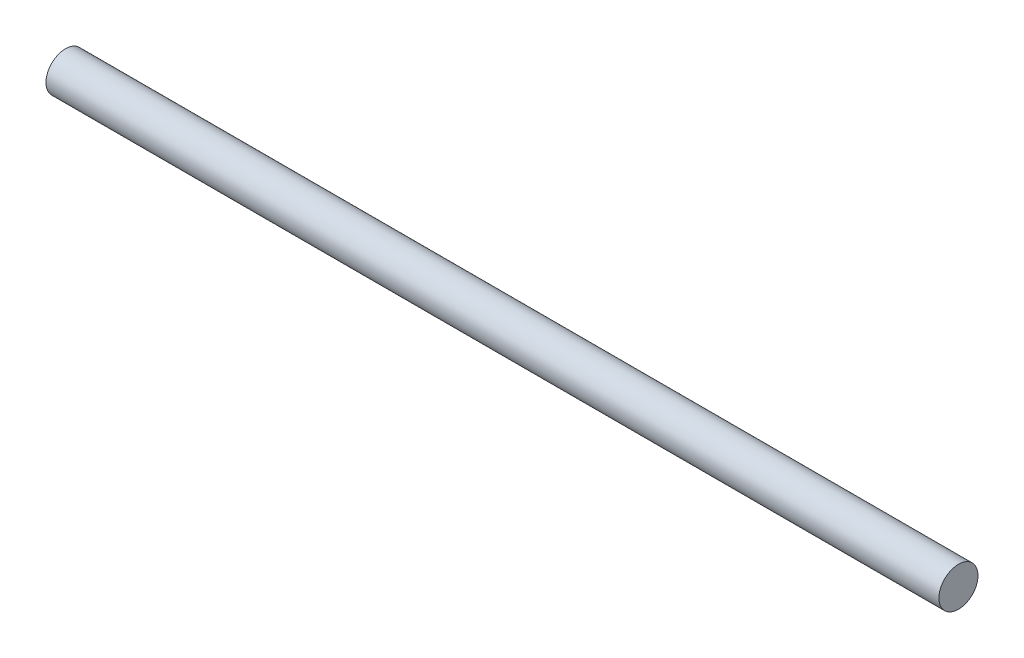
ISO-10303-21;
HEADER;
FILE_DESCRIPTION(('STEP AP214'),'2;1');
FILE_NAME('part.step','',(''),(''),'','','');
FILE_SCHEMA(('AUTOMOTIVE_DESIGN { 1 0 10303 214 1 1 1 1 }'));
ENDSEC;
DATA;
#1=APPLICATION_CONTEXT('core data for automotive mechanical design processes');
#2=APPLICATION_PROTOCOL_DEFINITION('international standard','automotive_design',2000,#1);
#3=PRODUCT_CONTEXT('',#1,'mechanical');
#4=PRODUCT('Part','Part','',(#3));
#5=PRODUCT_RELATED_PRODUCT_CATEGORY('part','',(#4));
#6=PRODUCT_DEFINITION_FORMATION('','',#4);
#7=PRODUCT_DEFINITION_CONTEXT('part definition',#1,'design');
#8=PRODUCT_DEFINITION('design','',#6,#7);
#9=PRODUCT_DEFINITION_SHAPE('','',#8);
#10=(LENGTH_UNIT() NAMED_UNIT(*) SI_UNIT(.MILLI.,.METRE.));
#11=(NAMED_UNIT(*) PLANE_ANGLE_UNIT() SI_UNIT($,.RADIAN.));
#12=(NAMED_UNIT(*) SI_UNIT($,.STERADIAN.) SOLID_ANGLE_UNIT());
#13=UNCERTAINTY_MEASURE_WITH_UNIT(LENGTH_MEASURE(1.E-05),#10,'distance_accuracy_value','');
#14=(GEOMETRIC_REPRESENTATION_CONTEXT(3) GLOBAL_UNCERTAINTY_ASSIGNED_CONTEXT((#13)) GLOBAL_UNIT_ASSIGNED_CONTEXT((#10,
#11,#12)) REPRESENTATION_CONTEXT('',''));
#15=CARTESIAN_POINT('',(0.,0.,0.));
#16=DIRECTION('',(0.,0.,1.));
#17=DIRECTION('',(1.,0.,0.));
#18=AXIS2_PLACEMENT_3D('',#15,#16,#17);
#19=CARTESIAN_POINT('',(160.,-31.8289766516955,58.3982168186026));
#20=DIRECTION('',(-1.,0.,0.));
#21=DIRECTION('',(0.,0.,1.));
#22=AXIS2_PLACEMENT_3D('',#19,#20,#21);
#23=CYLINDRICAL_SURFACE('',#22,3.5);
#24=CARTESIAN_POINT('',(160.,-31.8289766516955,58.3982168186026));
#25=DIRECTION('',(1.,0.,0.));
#26=DIRECTION('',(0.,0.,-1.));
#27=AXIS2_PLACEMENT_3D('',#24,#25,#26);
#28=CIRCLE('',#27,3.5);
#29=CARTESIAN_POINT('',(160.,-31.8289766516955,54.8982168186026));
#30=VERTEX_POINT('',#29);
#31=EDGE_CURVE('E10',#30,#30,#28,.T.);
#32=ORIENTED_EDGE('',*,*,#31,.F.);
#33=EDGE_LOOP('',(#32));
#34=FACE_BOUND('',#33,.T.);
#35=CARTESIAN_POINT('',(0.,-31.8289766516955,58.3982168186026));
#36=DIRECTION('',(1.,0.,0.));
#37=DIRECTION('',(0.,0.,-1.));
#38=AXIS2_PLACEMENT_3D('',#35,#36,#37);
#39=CIRCLE('',#38,3.5);
#40=CARTESIAN_POINT('',(0.,-31.8289766516955,54.8982168186026));
#41=VERTEX_POINT('',#40);
#42=EDGE_CURVE('E35',#41,#41,#39,.T.);
#43=ORIENTED_EDGE('',*,*,#42,.T.);
#44=EDGE_LOOP('',(#43));
#45=FACE_BOUND('',#44,.T.);
#46=ADVANCED_FACE('F32',(#34,#45),#23,.T.);
#47=CARTESIAN_POINT('',(160.,-31.8289766516955,58.3982168186026));
#48=DIRECTION('',(1.,0.,0.));
#49=DIRECTION('',(0.,0.,-1.));
#50=AXIS2_PLACEMENT_3D('',#47,#48,#49);
#51=PLANE('',#50);
#52=ORIENTED_EDGE('',*,*,#31,.T.);
#53=EDGE_LOOP('',(#52));
#54=FACE_BOUND('',#53,.T.);
#55=ADVANCED_FACE('F47',(#54),#51,.T.);
#56=CARTESIAN_POINT('',(0.,-31.8289766516955,58.3982168186026));
#57=DIRECTION('',(1.,0.,0.));
#58=DIRECTION('',(0.,0.,-1.));
#59=AXIS2_PLACEMENT_3D('',#56,#57,#58);
#60=PLANE('',#59);
#61=ORIENTED_EDGE('',*,*,#42,.F.);
#62=EDGE_LOOP('',(#61));
#63=FACE_BOUND('',#62,.T.);
#64=ADVANCED_FACE('F45',(#63),#60,.F.);
#65=CLOSED_SHELL('',(#46,#55,#64));
#66=MANIFOLD_SOLID_BREP('B2',#65);
#67=ADVANCED_BREP_SHAPE_REPRESENTATION('',(#18,#66),#14);
#68=SHAPE_DEFINITION_REPRESENTATION(#9,#67);
ENDSEC;
END-ISO-10303-21;
